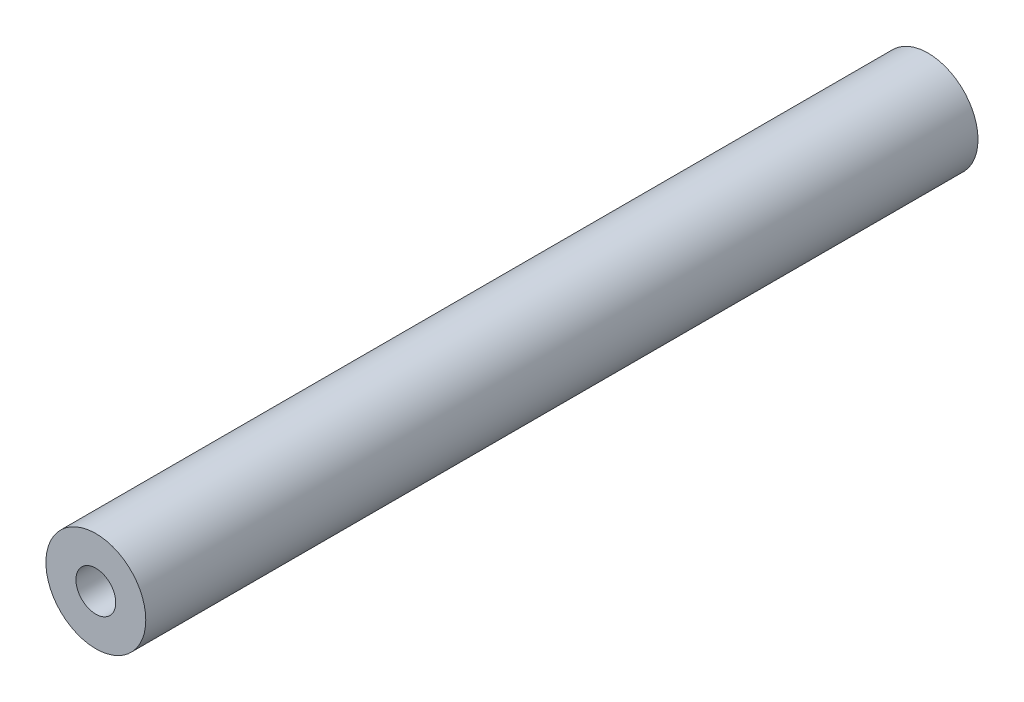
ISO-10303-21;
HEADER;
FILE_DESCRIPTION(('STEP AP214'),'2;1');
FILE_NAME('part.step','',(''),(''),'','','');
FILE_SCHEMA(('AUTOMOTIVE_DESIGN { 1 0 10303 214 1 1 1 1 }'));
ENDSEC;
DATA;
#1=APPLICATION_CONTEXT('core data for automotive mechanical design processes');
#2=APPLICATION_PROTOCOL_DEFINITION('international standard','automotive_design',2000,#1);
#3=PRODUCT_CONTEXT('',#1,'mechanical');
#4=PRODUCT('Part','Part','',(#3));
#5=PRODUCT_RELATED_PRODUCT_CATEGORY('part','',(#4));
#6=PRODUCT_DEFINITION_FORMATION('','',#4);
#7=PRODUCT_DEFINITION_CONTEXT('part definition',#1,'design');
#8=PRODUCT_DEFINITION('design','',#6,#7);
#9=PRODUCT_DEFINITION_SHAPE('','',#8);
#10=(LENGTH_UNIT() NAMED_UNIT(*) SI_UNIT(.MILLI.,.METRE.));
#11=(NAMED_UNIT(*) PLANE_ANGLE_UNIT() SI_UNIT($,.RADIAN.));
#12=(NAMED_UNIT(*) SI_UNIT($,.STERADIAN.) SOLID_ANGLE_UNIT());
#13=UNCERTAINTY_MEASURE_WITH_UNIT(LENGTH_MEASURE(1.E-05),#10,'distance_accuracy_value','');
#14=(GEOMETRIC_REPRESENTATION_CONTEXT(3) GLOBAL_UNCERTAINTY_ASSIGNED_CONTEXT((#13)) GLOBAL_UNIT_ASSIGNED_CONTEXT((#10,
#11,#12)) REPRESENTATION_CONTEXT('',''));
#15=CARTESIAN_POINT('',(0.,0.,0.));
#16=DIRECTION('',(0.,0.,1.));
#17=DIRECTION('',(1.,0.,0.));
#18=AXIS2_PLACEMENT_3D('',#15,#16,#17);
#19=CARTESIAN_POINT('',(0.,0.,79.375));
#20=DIRECTION('',(0.,0.,-1.));
#21=DIRECTION('',(-1.,0.,0.));
#22=AXIS2_PLACEMENT_3D('',#19,#20,#21);
#23=CYLINDRICAL_SURFACE('',#22,4.7625);
#24=CARTESIAN_POINT('',(0.,0.,79.375));
#25=DIRECTION('',(0.,0.,1.));
#26=DIRECTION('',(1.,0.,0.));
#27=AXIS2_PLACEMENT_3D('',#24,#25,#26);
#28=CIRCLE('',#27,4.7625);
#29=CARTESIAN_POINT('',(4.7625,0.,79.375));
#30=VERTEX_POINT('',#29);
#31=EDGE_CURVE('E10',#30,#30,#28,.T.);
#32=ORIENTED_EDGE('',*,*,#31,.F.);
#33=EDGE_LOOP('',(#32));
#34=FACE_BOUND('',#33,.T.);
#35=CARTESIAN_POINT('',(0.,0.,0.));
#36=DIRECTION('',(0.,0.,1.));
#37=DIRECTION('',(1.,0.,0.));
#38=AXIS2_PLACEMENT_3D('',#35,#36,#37);
#39=CIRCLE('',#38,4.7625);
#40=CARTESIAN_POINT('',(4.7625,0.,0.));
#41=VERTEX_POINT('',#40);
#42=EDGE_CURVE('E34',#41,#41,#39,.T.);
#43=ORIENTED_EDGE('',*,*,#42,.T.);
#44=EDGE_LOOP('',(#43));
#45=FACE_BOUND('',#44,.T.);
#46=ADVANCED_FACE('F31',(#34,#45),#23,.T.);
#47=CARTESIAN_POINT('',(0.,0.,79.375));
#48=DIRECTION('',(0.,0.,1.));
#49=DIRECTION('',(1.,0.,0.));
#50=AXIS2_PLACEMENT_3D('',#47,#48,#49);
#51=PLANE('',#50);
#52=CARTESIAN_POINT('',(0.,0.,79.375));
#53=DIRECTION('',(0.,0.,1.));
#54=DIRECTION('',(1.,0.,0.));
#55=AXIS2_PLACEMENT_3D('',#52,#53,#54);
#56=CIRCLE('',#55,1.89865);
#57=CARTESIAN_POINT('',(1.89865,0.,79.375));
#58=VERTEX_POINT('',#57);
#59=EDGE_CURVE('E43',#58,#58,#56,.T.);
#60=ORIENTED_EDGE('',*,*,#59,.F.);
#61=EDGE_LOOP('',(#60));
#62=FACE_BOUND('',#61,.T.);
#63=ORIENTED_EDGE('',*,*,#31,.T.);
#64=EDGE_LOOP('',(#63));
#65=FACE_BOUND('',#64,.T.);
#66=ADVANCED_FACE('F68',(#62,#65),#51,.T.);
#67=CARTESIAN_POINT('',(0.,0.,0.));
#68=DIRECTION('',(0.,0.,1.));
#69=DIRECTION('',(1.,0.,0.));
#70=AXIS2_PLACEMENT_3D('',#67,#68,#69);
#71=PLANE('',#70);
#72=CARTESIAN_POINT('',(0.,0.,0.));
#73=DIRECTION('',(0.,0.,-1.));
#74=DIRECTION('',(-1.,0.,0.));
#75=AXIS2_PLACEMENT_3D('',#72,#73,#74);
#76=CIRCLE('',#75,1.89865);
#77=CARTESIAN_POINT('',(-1.89865,0.,0.));
#78=VERTEX_POINT('',#77);
#79=EDGE_CURVE('E49',#78,#78,#76,.T.);
#80=ORIENTED_EDGE('',*,*,#79,.F.);
#81=EDGE_LOOP('',(#80));
#82=FACE_BOUND('',#81,.T.);
#83=ORIENTED_EDGE('',*,*,#42,.F.);
#84=EDGE_LOOP('',(#83));
#85=FACE_BOUND('',#84,.T.);
#86=ADVANCED_FACE('F64',(#82,#85),#71,.F.);
#87=CARTESIAN_POINT('',(0.,0.,53.975));
#88=DIRECTION('',(0.,0.,1.));
#89=DIRECTION('',(1.,0.,0.));
#90=AXIS2_PLACEMENT_3D('',#87,#88,#89);
#91=CYLINDRICAL_SURFACE('',#90,1.89865);
#92=CARTESIAN_POINT('',(0.,0.,53.975));
#93=DIRECTION('',(0.,0.,1.));
#94=DIRECTION('',(1.,0.,0.));
#95=AXIS2_PLACEMENT_3D('',#92,#93,#94);
#96=CIRCLE('',#95,1.89865);
#97=CARTESIAN_POINT('',(1.89865,0.,53.975));
#98=VERTEX_POINT('',#97);
#99=EDGE_CURVE('E41',#98,#98,#96,.T.);
#100=ORIENTED_EDGE('',*,*,#99,.F.);
#101=EDGE_LOOP('',(#100));
#102=FACE_BOUND('',#101,.T.);
#103=ORIENTED_EDGE('',*,*,#59,.T.);
#104=EDGE_LOOP('',(#103));
#105=FACE_BOUND('',#104,.T.);
#106=ADVANCED_FACE('F67',(#102,#105),#91,.F.);
#107=CARTESIAN_POINT('',(0.,0.,53.975));
#108=DIRECTION('',(0.,0.,1.));
#109=DIRECTION('',(1.,0.,0.));
#110=AXIS2_PLACEMENT_3D('',#107,#108,#109);
#111=PLANE('',#110);
#112=ORIENTED_EDGE('',*,*,#99,.T.);
#113=EDGE_LOOP('',(#112));
#114=FACE_BOUND('',#113,.T.);
#115=ADVANCED_FACE('F60',(#114),#111,.T.);
#116=CARTESIAN_POINT('',(0.,0.,25.4));
#117=DIRECTION('',(0.,0.,-1.));
#118=DIRECTION('',(-1.,0.,0.));
#119=AXIS2_PLACEMENT_3D('',#116,#117,#118);
#120=CYLINDRICAL_SURFACE('',#119,1.89865);
#121=CARTESIAN_POINT('',(0.,0.,25.4));
#122=DIRECTION('',(0.,0.,-1.));
#123=DIRECTION('',(-1.,0.,0.));
#124=AXIS2_PLACEMENT_3D('',#121,#122,#123);
#125=CIRCLE('',#124,1.89865);
#126=CARTESIAN_POINT('',(-1.89865,0.,25.4));
#127=VERTEX_POINT('',#126);
#128=EDGE_CURVE('E46',#127,#127,#125,.T.);
#129=ORIENTED_EDGE('',*,*,#128,.F.);
#130=EDGE_LOOP('',(#129));
#131=FACE_BOUND('',#130,.T.);
#132=ORIENTED_EDGE('',*,*,#79,.T.);
#133=EDGE_LOOP('',(#132));
#134=FACE_BOUND('',#133,.T.);
#135=ADVANCED_FACE('F57',(#131,#134),#120,.F.);
#136=CARTESIAN_POINT('',(0.,0.,25.4));
#137=DIRECTION('',(0.,0.,-1.));
#138=DIRECTION('',(-1.,0.,0.));
#139=AXIS2_PLACEMENT_3D('',#136,#137,#138);
#140=PLANE('',#139);
#141=ORIENTED_EDGE('',*,*,#128,.T.);
#142=EDGE_LOOP('',(#141));
#143=FACE_BOUND('',#142,.T.);
#144=ADVANCED_FACE('F55',(#143),#140,.T.);
#145=CLOSED_SHELL('',(#46,#66,#86,#106,#115,#135,#144));
#146=MANIFOLD_SOLID_BREP('B2',#145);
#147=ADVANCED_BREP_SHAPE_REPRESENTATION('',(#18,#146),#14);
#148=SHAPE_DEFINITION_REPRESENTATION(#9,#147);
ENDSEC;
END-ISO-10303-21;
